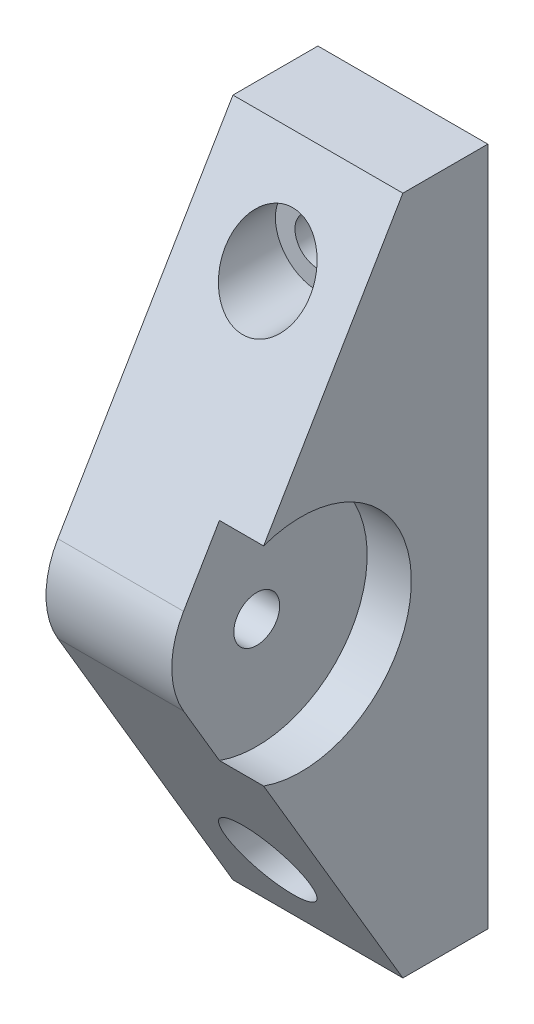
ISO-10303-21;
HEADER;
FILE_DESCRIPTION(('STEP AP214'),'2;1');
FILE_NAME('part.step','',(''),(''),'','','');
FILE_SCHEMA(('AUTOMOTIVE_DESIGN { 1 0 10303 214 1 1 1 1 }'));
ENDSEC;
DATA;
#1=APPLICATION_CONTEXT('core data for automotive mechanical design processes');
#2=APPLICATION_PROTOCOL_DEFINITION('international standard','automotive_design',2000,#1);
#3=PRODUCT_CONTEXT('',#1,'mechanical');
#4=PRODUCT('Part','Part','',(#3));
#5=PRODUCT_RELATED_PRODUCT_CATEGORY('part','',(#4));
#6=PRODUCT_DEFINITION_FORMATION('','',#4);
#7=PRODUCT_DEFINITION_CONTEXT('part definition',#1,'design');
#8=PRODUCT_DEFINITION('design','',#6,#7);
#9=PRODUCT_DEFINITION_SHAPE('','',#8);
#10=(LENGTH_UNIT() NAMED_UNIT(*) SI_UNIT(.MILLI.,.METRE.));
#11=(NAMED_UNIT(*) PLANE_ANGLE_UNIT() SI_UNIT($,.RADIAN.));
#12=(NAMED_UNIT(*) SI_UNIT($,.STERADIAN.) SOLID_ANGLE_UNIT());
#13=UNCERTAINTY_MEASURE_WITH_UNIT(LENGTH_MEASURE(1.E-05),#10,'distance_accuracy_value','');
#14=(GEOMETRIC_REPRESENTATION_CONTEXT(3) GLOBAL_UNCERTAINTY_ASSIGNED_CONTEXT((#13)) GLOBAL_UNIT_ASSIGNED_CONTEXT((#10,
#11,#12)) REPRESENTATION_CONTEXT('',''));
#15=CARTESIAN_POINT('',(0.,0.,0.));
#16=DIRECTION('',(0.,0.,1.));
#17=DIRECTION('',(1.,0.,0.));
#18=AXIS2_PLACEMENT_3D('',#15,#16,#17);
#19=CARTESIAN_POINT('',(10.,-30.,22.));
#20=DIRECTION('',(-1.,0.,0.));
#21=DIRECTION('',(0.,0.,1.));
#22=AXIS2_PLACEMENT_3D('',#19,#20,#21);
#23=CYLINDRICAL_SURFACE('',#22,10.);
#24=CARTESIAN_POINT('',(4.8,-30.,22.));
#25=DIRECTION('',(1.,0.,0.));
#26=DIRECTION('',(0.,1.,0.));
#27=AXIS2_PLACEMENT_3D('',#24,#25,#26);
#28=CIRCLE('',#27,10.);
#29=CARTESIAN_POINT('',(4.8,-24.9165410643055,30.6115297856483));
#30=VERTEX_POINT('',#29);
#31=CARTESIAN_POINT('',(4.79999999999999,-35.0834589356945,30.6115297856483));
#32=VERTEX_POINT('',#31);
#33=EDGE_CURVE('E60',#30,#32,#28,.T.);
#34=ORIENTED_EDGE('',*,*,#33,.F.);
#35=DIRECTION('',(-1.,0.,0.));
#36=VECTOR('',#35,1.);
#37=CARTESIAN_POINT('',(10.,-24.9165410643055,30.6115297856483));
#38=LINE('',#37,#36);
#39=CARTESIAN_POINT('',(-10.,-24.9165410643055,30.6115297856483));
#40=VERTEX_POINT('',#39);
#41=EDGE_CURVE('E180',#30,#40,#38,.T.);
#42=ORIENTED_EDGE('',*,*,#41,.T.);
#43=CARTESIAN_POINT('',(-10.,-30.,22.));
#44=DIRECTION('',(1.,0.,0.));
#45=DIRECTION('',(0.,0.,-1.));
#46=AXIS2_PLACEMENT_3D('',#43,#44,#45);
#47=CIRCLE('',#46,10.);
#48=CARTESIAN_POINT('',(-10.,-35.0834589356945,30.6115297856483));
#49=VERTEX_POINT('',#48);
#50=EDGE_CURVE('E165',#40,#49,#47,.T.);
#51=ORIENTED_EDGE('',*,*,#50,.T.);
#52=DIRECTION('',(-1.,0.,0.));
#53=VECTOR('',#52,1.);
#54=CARTESIAN_POINT('',(10.,-35.0834589356945,30.6115297856483));
#55=LINE('',#54,#53);
#56=EDGE_CURVE('E161',#32,#49,#55,.T.);
#57=ORIENTED_EDGE('',*,*,#56,.F.);
#58=EDGE_LOOP('',(#34,#42,#51,#57));
#59=FACE_BOUND('',#58,.T.);
#60=ADVANCED_FACE('F41',(#59),#23,.T.);
#61=CARTESIAN_POINT('',(10.,-30.,22.));
#62=DIRECTION('',(-1.,0.,0.));
#63=DIRECTION('',(0.,0.,1.));
#64=AXIS2_PLACEMENT_3D('',#61,#62,#63);
#65=CYLINDRICAL_SURFACE('',#64,2.70000000000001);
#66=CARTESIAN_POINT('',(-10.,-30.,22.));
#67=DIRECTION('',(1.,0.,0.));
#68=DIRECTION('',(0.,0.,-1.));
#69=AXIS2_PLACEMENT_3D('',#66,#67,#68);
#70=CIRCLE('',#69,2.70000000000001);
#71=CARTESIAN_POINT('',(-10.,-30.,19.3));
#72=VERTEX_POINT('',#71);
#73=EDGE_CURVE('E168',#72,#72,#70,.T.);
#74=ORIENTED_EDGE('',*,*,#73,.F.);
#75=EDGE_LOOP('',(#74));
#76=FACE_BOUND('',#75,.T.);
#77=CARTESIAN_POINT('',(4.8,-30.,22.));
#78=DIRECTION('',(1.,0.,0.));
#79=DIRECTION('',(0.,1.,0.));
#80=AXIS2_PLACEMENT_3D('',#77,#78,#79);
#81=CIRCLE('',#80,2.70000000000001);
#82=CARTESIAN_POINT('',(4.8,-27.3,22.));
#83=VERTEX_POINT('',#82);
#84=EDGE_CURVE('E228',#83,#83,#81,.T.);
#85=ORIENTED_EDGE('',*,*,#84,.T.);
#86=EDGE_LOOP('',(#85));
#87=FACE_BOUND('',#86,.T.);
#88=ADVANCED_FACE('F260',(#76,#87),#65,.F.);
#89=CARTESIAN_POINT('',(0.,0.,0.));
#90=DIRECTION('',(0.,0.,1.));
#91=DIRECTION('',(1.,0.,0.));
#92=AXIS2_PLACEMENT_3D('',#89,#90,#91);
#93=PLANE('',#92);
#94=DIRECTION('',(0.,-1.,0.));
#95=VECTOR('',#94,1.);
#96=CARTESIAN_POINT('',(-10.,10.,0.));
#97=LINE('',#96,#95);
#98=CARTESIAN_POINT('',(-10.,10.,0.));
#99=VERTEX_POINT('',#98);
#100=CARTESIAN_POINT('',(-9.99999999999999,-70.,0.));
#101=VERTEX_POINT('',#100);
#102=EDGE_CURVE('E191',#99,#101,#97,.T.);
#103=ORIENTED_EDGE('',*,*,#102,.F.);
#104=DIRECTION('',(-1.,0.,0.));
#105=VECTOR('',#104,1.);
#106=CARTESIAN_POINT('',(-10.,10.,0.));
#107=LINE('',#106,#105);
#108=CARTESIAN_POINT('',(10.,10.,0.));
#109=VERTEX_POINT('',#108);
#110=EDGE_CURVE('E96',#109,#99,#107,.T.);
#111=ORIENTED_EDGE('',*,*,#110,.F.);
#112=DIRECTION('',(0.,1.,0.));
#113=VECTOR('',#112,1.);
#114=CARTESIAN_POINT('',(10.,10.,0.));
#115=LINE('',#114,#113);
#116=CARTESIAN_POINT('',(9.99999999999999,-70.,0.));
#117=VERTEX_POINT('',#116);
#118=EDGE_CURVE('E204',#117,#109,#115,.T.);
#119=ORIENTED_EDGE('',*,*,#118,.F.);
#120=DIRECTION('',(1.,0.,0.));
#121=VECTOR('',#120,1.);
#122=CARTESIAN_POINT('',(-9.99999999999999,-70.,0.));
#123=LINE('',#122,#121);
#124=EDGE_CURVE('E201',#101,#117,#123,.T.);
#125=ORIENTED_EDGE('',*,*,#124,.F.);
#126=EDGE_LOOP('',(#103,#111,#119,#125));
#127=FACE_BOUND('',#126,.T.);
#128=CARTESIAN_POINT('',(0.,0.,0.));
#129=DIRECTION('',(0.,0.,1.));
#130=DIRECTION('',(1.,0.,0.));
#131=AXIS2_PLACEMENT_3D('',#128,#129,#130);
#132=CIRCLE('',#131,2.7);
#133=CARTESIAN_POINT('',(2.7,0.,0.));
#134=VERTEX_POINT('',#133);
#135=EDGE_CURVE('E187',#134,#134,#132,.T.);
#136=ORIENTED_EDGE('',*,*,#135,.T.);
#137=EDGE_LOOP('',(#136));
#138=FACE_BOUND('',#137,.T.);
#139=CARTESIAN_POINT('',(0.,-60.,0.));
#140=DIRECTION('',(0.,0.,1.));
#141=DIRECTION('',(1.,0.,0.));
#142=AXIS2_PLACEMENT_3D('',#139,#140,#141);
#143=CIRCLE('',#142,2.7);
#144=CARTESIAN_POINT('',(2.7,-60.,0.));
#145=VERTEX_POINT('',#144);
#146=EDGE_CURVE('E183',#145,#145,#143,.T.);
#147=ORIENTED_EDGE('',*,*,#146,.T.);
#148=EDGE_LOOP('',(#147));
#149=FACE_BOUND('',#148,.T.);
#150=ADVANCED_FACE('F262',(#127,#138,#149),#93,.F.);
#151=CARTESIAN_POINT('',(-10.,10.,10.));
#152=DIRECTION('',(1.,0.,0.));
#153=DIRECTION('',(0.,1.,0.));
#154=AXIS2_PLACEMENT_3D('',#151,#152,#153);
#155=PLANE('',#154);
#156=ORIENTED_EDGE('',*,*,#102,.T.);
#157=DIRECTION('',(0.,0.,-1.));
#158=VECTOR('',#157,1.);
#159=CARTESIAN_POINT('',(-9.99999999999999,-70.,10.));
#160=LINE('',#159,#158);
#161=CARTESIAN_POINT('',(-9.99999999999999,-70.,10.));
#162=VERTEX_POINT('',#161);
#163=EDGE_CURVE('E50',#162,#101,#160,.T.);
#164=ORIENTED_EDGE('',*,*,#163,.F.);
#165=DIRECTION('',(0.,-0.86115297856483,-0.508345893569449));
#166=VECTOR('',#165,1.);
#167=CARTESIAN_POINT('',(-10.,-35.0834589356945,30.6115297856483));
#168=LINE('',#167,#166);
#169=EDGE_CURVE('E157',#49,#162,#168,.T.);
#170=ORIENTED_EDGE('',*,*,#169,.F.);
#171=ORIENTED_EDGE('',*,*,#50,.F.);
#172=DIRECTION('',(0.,-0.86115297856483,0.508345893569449));
#173=VECTOR('',#172,1.);
#174=CARTESIAN_POINT('',(-10.,10.,10.));
#175=LINE('',#174,#173);
#176=CARTESIAN_POINT('',(-10.,10.,10.));
#177=VERTEX_POINT('',#176);
#178=EDGE_CURVE('E171',#177,#40,#175,.T.);
#179=ORIENTED_EDGE('',*,*,#178,.F.);
#180=DIRECTION('',(0.,0.,-1.));
#181=VECTOR('',#180,1.);
#182=CARTESIAN_POINT('',(-10.,10.,10.));
#183=LINE('',#182,#181);
#184=EDGE_CURVE('E197',#177,#99,#183,.T.);
#185=ORIENTED_EDGE('',*,*,#184,.T.);
#186=EDGE_LOOP('',(#156,#164,#170,#171,#179,#185));
#187=FACE_BOUND('',#186,.T.);
#188=ORIENTED_EDGE('',*,*,#73,.T.);
#189=EDGE_LOOP('',(#188));
#190=FACE_BOUND('',#189,.T.);
#191=ADVANCED_FACE('F43',(#187,#190),#155,.F.);
#192=CARTESIAN_POINT('',(-9.99999999999999,-70.,10.));
#193=DIRECTION('',(0.,1.,0.));
#194=DIRECTION('',(0.,0.,1.));
#195=AXIS2_PLACEMENT_3D('',#192,#193,#194);
#196=PLANE('',#195);
#197=ORIENTED_EDGE('',*,*,#124,.T.);
#198=DIRECTION('',(0.,0.,-1.));
#199=VECTOR('',#198,1.);
#200=CARTESIAN_POINT('',(9.99999999999999,-70.,10.));
#201=LINE('',#200,#199);
#202=CARTESIAN_POINT('',(9.99999999999999,-70.,10.));
#203=VERTEX_POINT('',#202);
#204=EDGE_CURVE('E213',#203,#117,#201,.T.);
#205=ORIENTED_EDGE('',*,*,#204,.F.);
#206=DIRECTION('',(1.,0.,0.));
#207=VECTOR('',#206,1.);
#208=CARTESIAN_POINT('',(-9.99999999999999,-70.,10.));
#209=LINE('',#208,#207);
#210=EDGE_CURVE('E105',#162,#203,#209,.T.);
#211=ORIENTED_EDGE('',*,*,#210,.F.);
#212=ORIENTED_EDGE('',*,*,#163,.T.);
#213=EDGE_LOOP('',(#197,#205,#211,#212));
#214=FACE_BOUND('',#213,.T.);
#215=ADVANCED_FACE('F295',(#214),#196,.F.);
#216=CARTESIAN_POINT('',(10.,10.,10.));
#217=DIRECTION('',(-1.,0.,0.));
#218=DIRECTION('',(0.,-1.,0.));
#219=AXIS2_PLACEMENT_3D('',#216,#217,#218);
#220=PLANE('',#219);
#221=DIRECTION('',(0.,-0.86115297856483,0.508345893569449));
#222=VECTOR('',#221,1.);
#223=CARTESIAN_POINT('',(10.,10.,10.));
#224=LINE('',#223,#222);
#225=CARTESIAN_POINT('',(10.,10.,10.));
#226=VERTEX_POINT('',#225);
#227=CARTESIAN_POINT('',(9.99999999999999,-17.7632671829359,26.3888916555079));
#228=VERTEX_POINT('',#227);
#229=EDGE_CURVE('E148',#226,#228,#224,.T.);
#230=ORIENTED_EDGE('',*,*,#229,.T.);
#231=CARTESIAN_POINT('',(9.99999999999999,-30.,22.));
#232=DIRECTION('',(1.,0.,0.));
#233=DIRECTION('',(0.,1.,0.));
#234=AXIS2_PLACEMENT_3D('',#231,#232,#233);
#235=CIRCLE('',#234,13.);
#236=CARTESIAN_POINT('',(9.99999999999999,-42.2367328170641,26.3888916555079));
#237=VERTEX_POINT('',#236);
#238=EDGE_CURVE('E133',#237,#228,#235,.T.);
#239=ORIENTED_EDGE('',*,*,#238,.F.);
#240=DIRECTION('',(0.,-0.86115297856483,-0.508345893569449));
#241=VECTOR('',#240,1.);
#242=CARTESIAN_POINT('',(10.,-35.0834589356945,30.6115297856483));
#243=LINE('',#242,#241);
#244=EDGE_CURVE('E156',#237,#203,#243,.T.);
#245=ORIENTED_EDGE('',*,*,#244,.T.);
#246=ORIENTED_EDGE('',*,*,#204,.T.);
#247=ORIENTED_EDGE('',*,*,#118,.T.);
#248=DIRECTION('',(0.,0.,-1.));
#249=VECTOR('',#248,1.);
#250=CARTESIAN_POINT('',(10.,10.,10.));
#251=LINE('',#250,#249);
#252=EDGE_CURVE('E72',#226,#109,#251,.T.);
#253=ORIENTED_EDGE('',*,*,#252,.F.);
#254=EDGE_LOOP('',(#230,#239,#245,#246,#247,#253));
#255=FACE_BOUND('',#254,.T.);
#256=ADVANCED_FACE('F154',(#255),#220,.F.);
#257=CARTESIAN_POINT('',(-10.,10.,10.));
#258=DIRECTION('',(0.,-1.,0.));
#259=DIRECTION('',(0.,0.,-1.));
#260=AXIS2_PLACEMENT_3D('',#257,#258,#259);
#261=PLANE('',#260);
#262=ORIENTED_EDGE('',*,*,#110,.T.);
#263=ORIENTED_EDGE('',*,*,#184,.F.);
#264=DIRECTION('',(-1.,0.,0.));
#265=VECTOR('',#264,1.);
#266=CARTESIAN_POINT('',(-10.,10.,10.));
#267=LINE('',#266,#265);
#268=EDGE_CURVE('E194',#226,#177,#267,.T.);
#269=ORIENTED_EDGE('',*,*,#268,.F.);
#270=ORIENTED_EDGE('',*,*,#252,.T.);
#271=EDGE_LOOP('',(#262,#263,#269,#270));
#272=FACE_BOUND('',#271,.T.);
#273=ADVANCED_FACE('F289',(#272),#261,.F.);
#274=CARTESIAN_POINT('',(0.,0.,10.));
#275=DIRECTION('',(0.,0.,-1.));
#276=DIRECTION('',(-1.,0.,0.));
#277=AXIS2_PLACEMENT_3D('',#274,#275,#276);
#278=CYLINDRICAL_SURFACE('',#277,2.7);
#279=CARTESIAN_POINT('',(0.,0.,10.));
#280=DIRECTION('',(0.,0.,-1.));
#281=DIRECTION('',(-1.,0.,0.));
#282=AXIS2_PLACEMENT_3D('',#279,#280,#281);
#283=CIRCLE('',#282,2.7);
#284=CARTESIAN_POINT('',(-2.7,0.,10.));
#285=VERTEX_POINT('',#284);
#286=EDGE_CURVE('E227',#285,#285,#283,.T.);
#287=ORIENTED_EDGE('',*,*,#286,.F.);
#288=EDGE_LOOP('',(#287));
#289=FACE_BOUND('',#288,.T.);
#290=ORIENTED_EDGE('',*,*,#135,.F.);
#291=EDGE_LOOP('',(#290));
#292=FACE_BOUND('',#291,.T.);
#293=ADVANCED_FACE('F286',(#289,#292),#278,.F.);
#294=CARTESIAN_POINT('',(0.,-60.,10.));
#295=DIRECTION('',(0.,0.,-1.));
#296=DIRECTION('',(-1.,0.,0.));
#297=AXIS2_PLACEMENT_3D('',#294,#295,#296);
#298=CYLINDRICAL_SURFACE('',#297,2.7);
#299=CARTESIAN_POINT('',(0.,-60.,10.));
#300=DIRECTION('',(0.,0.,-1.));
#301=DIRECTION('',(-1.,0.,0.));
#302=AXIS2_PLACEMENT_3D('',#299,#300,#301);
#303=CIRCLE('',#302,2.7);
#304=CARTESIAN_POINT('',(-2.7,-60.,10.));
#305=VERTEX_POINT('',#304);
#306=EDGE_CURVE('E222',#305,#305,#303,.T.);
#307=ORIENTED_EDGE('',*,*,#306,.F.);
#308=EDGE_LOOP('',(#307));
#309=FACE_BOUND('',#308,.T.);
#310=ORIENTED_EDGE('',*,*,#146,.F.);
#311=EDGE_LOOP('',(#310));
#312=FACE_BOUND('',#311,.T.);
#313=ADVANCED_FACE('F282',(#309,#312),#298,.F.);
#314=CARTESIAN_POINT('',(10.,10.,10.));
#315=DIRECTION('',(0.,-0.508345893569449,-0.86115297856483));
#316=DIRECTION('',(0.,0.86115297856483,-0.508345893569449));
#317=AXIS2_PLACEMENT_3D('',#314,#315,#316);
#318=PLANE('',#317);
#319=CARTESIAN_POINT('',(0.,0.,15.9030846576951));
#320=DIRECTION('',(0.,-0.508345893569449,-0.86115297856483));
#321=DIRECTION('',(0.,0.86115297856483,-0.508345893569449));
#322=AXIS2_PLACEMENT_3D('',#319,#320,#321);
#323=ELLIPSE('',#322,5.80616931539021,5.);
#324=CARTESIAN_POINT('',(0.,5.,12.9515423288476));
#325=VERTEX_POINT('',#324);
#326=EDGE_CURVE('E224',#325,#325,#323,.T.);
#327=ORIENTED_EDGE('',*,*,#326,.T.);
#328=EDGE_LOOP('',(#327));
#329=FACE_BOUND('',#328,.T.);
#330=DIRECTION('',(0.,-0.86115297856483,0.508345893569449));
#331=VECTOR('',#330,1.);
#332=CARTESIAN_POINT('',(4.8,10.,10.));
#333=LINE('',#332,#331);
#334=CARTESIAN_POINT('',(4.8,-17.7632671829359,26.3888916555079));
#335=VERTEX_POINT('',#334);
#336=EDGE_CURVE('E150',#335,#30,#333,.T.);
#337=ORIENTED_EDGE('',*,*,#336,.F.);
#338=DIRECTION('',(1.,0.,0.));
#339=VECTOR('',#338,1.);
#340=CARTESIAN_POINT('',(4.8,-17.7632671829359,26.3888916555079));
#341=LINE('',#340,#339);
#342=EDGE_CURVE('E137',#335,#228,#341,.T.);
#343=ORIENTED_EDGE('',*,*,#342,.T.);
#344=ORIENTED_EDGE('',*,*,#229,.F.);
#345=ORIENTED_EDGE('',*,*,#268,.T.);
#346=ORIENTED_EDGE('',*,*,#178,.T.);
#347=ORIENTED_EDGE('',*,*,#41,.F.);
#348=EDGE_LOOP('',(#337,#343,#344,#345,#346,#347));
#349=FACE_BOUND('',#348,.T.);
#350=ADVANCED_FACE('F146',(#329,#349),#318,.F.);
#351=CARTESIAN_POINT('',(10.,-35.0834589356945,30.6115297856483));
#352=DIRECTION('',(0.,0.508345893569449,-0.86115297856483));
#353=DIRECTION('',(0.,0.86115297856483,0.508345893569449));
#354=AXIS2_PLACEMENT_3D('',#351,#352,#353);
#355=PLANE('',#354);
#356=CARTESIAN_POINT('',(0.,-60.,15.9030846576951));
#357=DIRECTION('',(0.,0.508345893569449,-0.86115297856483));
#358=DIRECTION('',(0.,-0.86115297856483,-0.508345893569449));
#359=AXIS2_PLACEMENT_3D('',#356,#357,#358);
#360=ELLIPSE('',#359,5.80616931539021,5.);
#361=CARTESIAN_POINT('',(0.,-65.,12.9515423288476));
#362=VERTEX_POINT('',#361);
#363=EDGE_CURVE('E218',#362,#362,#360,.T.);
#364=ORIENTED_EDGE('',*,*,#363,.T.);
#365=EDGE_LOOP('',(#364));
#366=FACE_BOUND('',#365,.T.);
#367=ORIENTED_EDGE('',*,*,#244,.F.);
#368=DIRECTION('',(1.,0.,0.));
#369=VECTOR('',#368,1.);
#370=CARTESIAN_POINT('',(4.79999999999999,-42.2367328170641,26.3888916555079));
#371=LINE('',#370,#369);
#372=CARTESIAN_POINT('',(4.79999999999999,-42.2367328170641,26.3888916555079));
#373=VERTEX_POINT('',#372);
#374=EDGE_CURVE('E11',#237,#373,#371,.F.);
#375=ORIENTED_EDGE('',*,*,#374,.T.);
#376=DIRECTION('',(0.,-0.86115297856483,-0.508345893569449));
#377=VECTOR('',#376,1.);
#378=CARTESIAN_POINT('',(4.79999999999999,-35.0834589356945,30.6115297856483));
#379=LINE('',#378,#377);
#380=EDGE_CURVE('E231',#32,#373,#379,.T.);
#381=ORIENTED_EDGE('',*,*,#380,.F.);
#382=ORIENTED_EDGE('',*,*,#56,.T.);
#383=ORIENTED_EDGE('',*,*,#169,.T.);
#384=ORIENTED_EDGE('',*,*,#210,.T.);
#385=EDGE_LOOP('',(#367,#375,#381,#382,#383,#384));
#386=FACE_BOUND('',#385,.T.);
#387=ADVANCED_FACE('F276',(#366,#386),#355,.F.);
#388=CARTESIAN_POINT('',(0.,-60.,32.));
#389=DIRECTION('',(0.,0.,-1.));
#390=DIRECTION('',(-1.,0.,0.));
#391=AXIS2_PLACEMENT_3D('',#388,#389,#390);
#392=CYLINDRICAL_SURFACE('',#391,5.);
#393=CARTESIAN_POINT('',(0.,-60.,10.));
#394=DIRECTION('',(0.,0.,-1.));
#395=DIRECTION('',(-1.,0.,0.));
#396=AXIS2_PLACEMENT_3D('',#393,#394,#395);
#397=CIRCLE('',#396,5.);
#398=CARTESIAN_POINT('',(-5.,-60.,10.));
#399=VERTEX_POINT('',#398);
#400=EDGE_CURVE('E223',#399,#399,#397,.T.);
#401=ORIENTED_EDGE('',*,*,#400,.T.);
#402=EDGE_LOOP('',(#401));
#403=FACE_BOUND('',#402,.T.);
#404=ORIENTED_EDGE('',*,*,#363,.F.);
#405=EDGE_LOOP('',(#404));
#406=FACE_BOUND('',#405,.T.);
#407=ADVANCED_FACE('F274',(#403,#406),#392,.F.);
#408=CARTESIAN_POINT('',(0.,-60.,10.));
#409=DIRECTION('',(0.,0.,-1.));
#410=DIRECTION('',(-1.,0.,0.));
#411=AXIS2_PLACEMENT_3D('',#408,#409,#410);
#412=PLANE('',#411);
#413=ORIENTED_EDGE('',*,*,#306,.T.);
#414=EDGE_LOOP('',(#413));
#415=FACE_BOUND('',#414,.T.);
#416=ORIENTED_EDGE('',*,*,#400,.F.);
#417=EDGE_LOOP('',(#416));
#418=FACE_BOUND('',#417,.T.);
#419=ADVANCED_FACE('F324',(#415,#418),#412,.F.);
#420=CARTESIAN_POINT('',(0.,0.,32.));
#421=DIRECTION('',(0.,0.,-1.));
#422=DIRECTION('',(-1.,0.,0.));
#423=AXIS2_PLACEMENT_3D('',#420,#421,#422);
#424=CYLINDRICAL_SURFACE('',#423,5.);
#425=CARTESIAN_POINT('',(0.,0.,10.));
#426=DIRECTION('',(0.,0.,-1.));
#427=DIRECTION('',(-1.,0.,0.));
#428=AXIS2_PLACEMENT_3D('',#425,#426,#427);
#429=CIRCLE('',#428,5.);
#430=CARTESIAN_POINT('',(-5.,0.,10.));
#431=VERTEX_POINT('',#430);
#432=EDGE_CURVE('E152',#431,#431,#429,.T.);
#433=ORIENTED_EDGE('',*,*,#432,.T.);
#434=EDGE_LOOP('',(#433));
#435=FACE_BOUND('',#434,.T.);
#436=ORIENTED_EDGE('',*,*,#326,.F.);
#437=EDGE_LOOP('',(#436));
#438=FACE_BOUND('',#437,.T.);
#439=ADVANCED_FACE('F321',(#435,#438),#424,.F.);
#440=CARTESIAN_POINT('',(0.,0.,10.));
#441=DIRECTION('',(0.,0.,-1.));
#442=DIRECTION('',(-1.,0.,0.));
#443=AXIS2_PLACEMENT_3D('',#440,#441,#442);
#444=PLANE('',#443);
#445=ORIENTED_EDGE('',*,*,#286,.T.);
#446=EDGE_LOOP('',(#445));
#447=FACE_BOUND('',#446,.T.);
#448=ORIENTED_EDGE('',*,*,#432,.F.);
#449=EDGE_LOOP('',(#448));
#450=FACE_BOUND('',#449,.T.);
#451=ADVANCED_FACE('F316',(#447,#450),#444,.F.);
#452=CARTESIAN_POINT('',(4.8,-30.,22.));
#453=DIRECTION('',(1.,0.,0.));
#454=DIRECTION('',(0.,1.,0.));
#455=AXIS2_PLACEMENT_3D('',#452,#453,#454);
#456=CYLINDRICAL_SURFACE('',#455,13.);
#457=CARTESIAN_POINT('',(4.8,-30.,22.));
#458=DIRECTION('',(1.,0.,0.));
#459=DIRECTION('',(0.,1.,0.));
#460=AXIS2_PLACEMENT_3D('',#457,#458,#459);
#461=CIRCLE('',#460,13.);
#462=EDGE_CURVE('E141',#373,#335,#461,.T.);
#463=ORIENTED_EDGE('',*,*,#462,.F.);
#464=ORIENTED_EDGE('',*,*,#374,.F.);
#465=ORIENTED_EDGE('',*,*,#238,.T.);
#466=ORIENTED_EDGE('',*,*,#342,.F.);
#467=EDGE_LOOP('',(#463,#464,#465,#466));
#468=FACE_BOUND('',#467,.T.);
#469=ADVANCED_FACE('F136',(#468),#456,.F.);
#470=CARTESIAN_POINT('',(4.8,-30.,22.));
#471=DIRECTION('',(1.,0.,0.));
#472=DIRECTION('',(0.,1.,0.));
#473=AXIS2_PLACEMENT_3D('',#470,#471,#472);
#474=PLANE('',#473);
#475=ORIENTED_EDGE('',*,*,#84,.F.);
#476=EDGE_LOOP('',(#475));
#477=FACE_BOUND('',#476,.T.);
#478=ORIENTED_EDGE('',*,*,#336,.T.);
#479=ORIENTED_EDGE('',*,*,#33,.T.);
#480=ORIENTED_EDGE('',*,*,#380,.T.);
#481=ORIENTED_EDGE('',*,*,#462,.T.);
#482=EDGE_LOOP('',(#478,#479,#480,#481));
#483=FACE_BOUND('',#482,.T.);
#484=ADVANCED_FACE('F309',(#477,#483),#474,.T.);
#485=CLOSED_SHELL('',(#60,#88,#150,#191,#215,#256,#273,#293,#313,#350,#387,#407,#419,#439,#451,
#469,#484));
#486=MANIFOLD_SOLID_BREP('B2',#485);
#487=ADVANCED_BREP_SHAPE_REPRESENTATION('',(#18,#486),#14);
#488=SHAPE_DEFINITION_REPRESENTATION(#9,#487);
ENDSEC;
END-ISO-10303-21;
